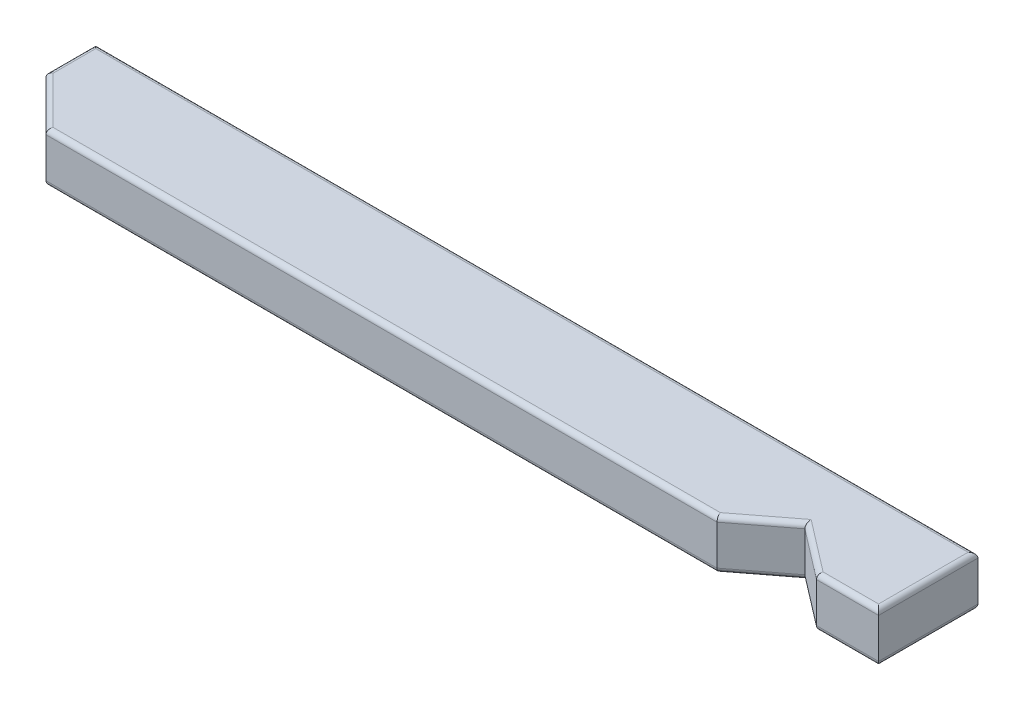
ISO-10303-21;
HEADER;
FILE_DESCRIPTION(('STEP AP214'),'2;1');
FILE_NAME('part.step','',(''),(''),'','','');
FILE_SCHEMA(('AUTOMOTIVE_DESIGN { 1 0 10303 214 1 1 1 1 }'));
ENDSEC;
DATA;
#1=APPLICATION_CONTEXT('core data for automotive mechanical design processes');
#2=APPLICATION_PROTOCOL_DEFINITION('international standard','automotive_design',2000,#1);
#3=PRODUCT_CONTEXT('',#1,'mechanical');
#4=PRODUCT('Part','Part','',(#3));
#5=PRODUCT_RELATED_PRODUCT_CATEGORY('part','',(#4));
#6=PRODUCT_DEFINITION_FORMATION('','',#4);
#7=PRODUCT_DEFINITION_CONTEXT('part definition',#1,'design');
#8=PRODUCT_DEFINITION('design','',#6,#7);
#9=PRODUCT_DEFINITION_SHAPE('','',#8);
#10=(LENGTH_UNIT() NAMED_UNIT(*) SI_UNIT(.MILLI.,.METRE.));
#11=(NAMED_UNIT(*) PLANE_ANGLE_UNIT() SI_UNIT($,.RADIAN.));
#12=(NAMED_UNIT(*) SI_UNIT($,.STERADIAN.) SOLID_ANGLE_UNIT());
#13=UNCERTAINTY_MEASURE_WITH_UNIT(LENGTH_MEASURE(1.E-05),#10,'distance_accuracy_value','');
#14=(GEOMETRIC_REPRESENTATION_CONTEXT(3) GLOBAL_UNCERTAINTY_ASSIGNED_CONTEXT((#13)) GLOBAL_UNIT_ASSIGNED_CONTEXT((#10,
#11,#12)) REPRESENTATION_CONTEXT('',''));
#15=CARTESIAN_POINT('',(0.,0.,0.));
#16=DIRECTION('',(0.,0.,1.));
#17=DIRECTION('',(1.,0.,0.));
#18=AXIS2_PLACEMENT_3D('',#15,#16,#17);
#19=CARTESIAN_POINT('',(2714.29999999996,38.1000000000004,-287.700000000002));
#20=DIRECTION('',(0.,0.,1.));
#21=DIRECTION('',(0.,-1.,0.));
#22=AXIS2_PLACEMENT_3D('',#19,#20,#21);
#23=PLANE('',#22);
#24=DIRECTION('',(0.,1.,0.));
#25=VECTOR('',#24,1.);
#26=CARTESIAN_POINT('',(1863.49999999996,-12.7000000000106,-287.700000000001));
#27=LINE('',#26,#25);
#28=CARTESIAN_POINT('',(1863.49999999996,-7.62000000000406,-287.700000000001));
#29=VERTEX_POINT('',#28);
#30=CARTESIAN_POINT('',(1863.49999999996,33.0199999999959,-287.700000000002));
#31=VERTEX_POINT('',#30);
#32=EDGE_CURVE('E211',#29,#31,#27,.T.);
#33=ORIENTED_EDGE('',*,*,#32,.F.);
#34=DIRECTION('',(-1.,0.,0.));
#35=VECTOR('',#34,1.);
#36=CARTESIAN_POINT('',(2714.29999999996,-7.61999999999961,-287.700000000001));
#37=LINE('',#36,#35);
#38=CARTESIAN_POINT('',(2549.19999999996,-7.62000000000047,-287.700000000001));
#39=VERTEX_POINT('',#38);
#40=EDGE_CURVE('E262',#29,#39,#37,.F.);
#41=ORIENTED_EDGE('',*,*,#40,.T.);
#42=DIRECTION('',(0.,1.,0.));
#43=VECTOR('',#42,1.);
#44=CARTESIAN_POINT('',(2549.19999999996,-12.700000000007,-287.700000000001));
#45=LINE('',#44,#43);
#46=CARTESIAN_POINT('',(2549.19999999996,33.0199999999995,-287.700000000002));
#47=VERTEX_POINT('',#46);
#48=EDGE_CURVE('E340',#39,#47,#45,.T.);
#49=ORIENTED_EDGE('',*,*,#48,.T.);
#50=DIRECTION('',(-1.,0.,0.));
#51=VECTOR('',#50,1.);
#52=CARTESIAN_POINT('',(1863.49999999996,33.0199999999959,-287.700000000002));
#53=LINE('',#52,#51);
#54=EDGE_CURVE('E265',#47,#31,#53,.T.);
#55=ORIENTED_EDGE('',*,*,#54,.T.);
#56=EDGE_LOOP('',(#33,#41,#49,#55));
#57=FACE_BOUND('',#56,.T.);
#58=ADVANCED_FACE('F43',(#57),#23,.T.);
#59=CARTESIAN_POINT('',(2714.29999999996,38.0999999999986,-389.300000000002));
#60=DIRECTION('',(1.,0.,0.));
#61=DIRECTION('',(0.,1.,0.));
#62=AXIS2_PLACEMENT_3D('',#59,#60,#61);
#63=PLANE('',#62);
#64=DIRECTION('',(0.,-1.,0.));
#65=VECTOR('',#64,1.);
#66=CARTESIAN_POINT('',(2714.29999999996,38.1000000000004,-287.700000000002));
#67=LINE('',#66,#65);
#68=CARTESIAN_POINT('',(2714.29999999996,33.0200000000004,-287.700000000002));
#69=VERTEX_POINT('',#68);
#70=CARTESIAN_POINT('',(2714.29999999996,-7.61999999999961,-287.700000000001));
#71=VERTEX_POINT('',#70);
#72=EDGE_CURVE('E335',#69,#71,#67,.T.);
#73=ORIENTED_EDGE('',*,*,#72,.T.);
#74=DIRECTION('',(0.,0.,1.));
#75=VECTOR('',#74,1.);
#76=CARTESIAN_POINT('',(2714.29999999996,-7.62000000000144,-389.300000000001));
#77=LINE('',#76,#75);
#78=CARTESIAN_POINT('',(2714.29999999996,-7.62000000000144,-389.300000000001));
#79=VERTEX_POINT('',#78);
#80=EDGE_CURVE('E280',#71,#79,#77,.F.);
#81=ORIENTED_EDGE('',*,*,#80,.T.);
#82=DIRECTION('',(0.,-1.,0.));
#83=VECTOR('',#82,1.);
#84=CARTESIAN_POINT('',(2714.29999999996,38.0999999999986,-389.300000000002));
#85=LINE('',#84,#83);
#86=CARTESIAN_POINT('',(2714.29999999996,33.0199999999986,-389.300000000002));
#87=VERTEX_POINT('',#86);
#88=EDGE_CURVE('E181',#87,#79,#85,.T.);
#89=ORIENTED_EDGE('',*,*,#88,.F.);
#90=DIRECTION('',(0.,0.,1.));
#91=VECTOR('',#90,1.);
#92=CARTESIAN_POINT('',(2714.29999999996,33.0200000000004,-287.700000000002));
#93=LINE('',#92,#91);
#94=EDGE_CURVE('E283',#87,#69,#93,.T.);
#95=ORIENTED_EDGE('',*,*,#94,.T.);
#96=EDGE_LOOP('',(#73,#81,#89,#95));
#97=FACE_BOUND('',#96,.T.);
#98=ADVANCED_FACE('F403',(#97),#63,.T.);
#99=CARTESIAN_POINT('',(2714.29999999996,38.0999999999986,-389.300000000002));
#100=DIRECTION('',(0.,0.,-1.));
#101=DIRECTION('',(0.,1.,0.));
#102=AXIS2_PLACEMENT_3D('',#99,#100,#101);
#103=PLANE('',#102);
#104=ORIENTED_EDGE('',*,*,#88,.T.);
#105=DIRECTION('',(1.,0.,0.));
#106=VECTOR('',#105,1.);
#107=CARTESIAN_POINT('',(2714.29999999996,-7.62000000000145,-389.300000000001));
#108=LINE('',#107,#106);
#109=CARTESIAN_POINT('',(1812.69999999996,-7.62000000000616,-389.300000000001));
#110=VERTEX_POINT('',#109);
#111=EDGE_CURVE('E11',#79,#110,#108,.F.);
#112=ORIENTED_EDGE('',*,*,#111,.T.);
#113=DIRECTION('',(0.,-1.,0.));
#114=VECTOR('',#113,1.);
#115=CARTESIAN_POINT('',(1812.69999999996,38.0999999999938,-389.300000000002));
#116=LINE('',#115,#114);
#117=CARTESIAN_POINT('',(1812.69999999996,33.0199999999938,-389.300000000002));
#118=VERTEX_POINT('',#117);
#119=EDGE_CURVE('E339',#118,#110,#116,.T.);
#120=ORIENTED_EDGE('',*,*,#119,.F.);
#121=DIRECTION('',(1.,0.,0.));
#122=VECTOR('',#121,1.);
#123=CARTESIAN_POINT('',(2714.29999999996,33.0199999999986,-389.300000000002));
#124=LINE('',#123,#122);
#125=EDGE_CURVE('E53',#118,#87,#124,.T.);
#126=ORIENTED_EDGE('',*,*,#125,.T.);
#127=EDGE_LOOP('',(#104,#112,#120,#126));
#128=FACE_BOUND('',#127,.T.);
#129=ADVANCED_FACE('F387',(#128),#103,.T.);
#130=CARTESIAN_POINT('',(1812.69999999996,38.0999999999938,-389.300000000002));
#131=DIRECTION('',(-1.,0.,0.));
#132=DIRECTION('',(0.,-1.,0.));
#133=AXIS2_PLACEMENT_3D('',#130,#131,#132);
#134=PLANE('',#133);
#135=ORIENTED_EDGE('',*,*,#119,.T.);
#136=DIRECTION('',(0.,0.,-1.));
#137=VECTOR('',#136,1.);
#138=CARTESIAN_POINT('',(1812.69999999996,-7.62000000000616,-389.300000000001));
#139=LINE('',#138,#137);
#140=CARTESIAN_POINT('',(1812.69999999996,-7.62000000000524,-338.5));
#141=VERTEX_POINT('',#140);
#142=EDGE_CURVE('E184',#110,#141,#139,.F.);
#143=ORIENTED_EDGE('',*,*,#142,.T.);
#144=DIRECTION('',(0.,1.,0.));
#145=VECTOR('',#144,1.);
#146=CARTESIAN_POINT('',(1812.69999999996,-12.7000000000118,-338.5));
#147=LINE('',#146,#145);
#148=CARTESIAN_POINT('',(1812.69999999996,33.0199999999947,-338.500000000001));
#149=VERTEX_POINT('',#148);
#150=EDGE_CURVE('E348',#141,#149,#147,.T.);
#151=ORIENTED_EDGE('',*,*,#150,.T.);
#152=DIRECTION('',(0.,0.,-1.));
#153=VECTOR('',#152,1.);
#154=CARTESIAN_POINT('',(1812.69999999996,33.0199999999938,-389.300000000002));
#155=LINE('',#154,#153);
#156=EDGE_CURVE('E66',#149,#118,#155,.T.);
#157=ORIENTED_EDGE('',*,*,#156,.T.);
#158=EDGE_LOOP('',(#135,#143,#151,#157));
#159=FACE_BOUND('',#158,.T.);
#160=ADVANCED_FACE('F385',(#159),#134,.T.);
#161=DIRECTION('',(0.,1.,0.));
#162=VECTOR('',#161,1.);
#163=CARTESIAN_POINT('',(2650.79999999996,-12.7000000000065,-287.700000000001));
#164=LINE('',#163,#162);
#165=CARTESIAN_POINT('',(2650.79999999996,-7.61999999999994,-287.700000000001));
#166=VERTEX_POINT('',#165);
#167=CARTESIAN_POINT('',(2650.79999999996,33.02,-287.700000000002));
#168=VERTEX_POINT('',#167);
#169=EDGE_CURVE('E351',#166,#168,#164,.T.);
#170=ORIENTED_EDGE('',*,*,#169,.F.);
#171=DIRECTION('',(-1.,0.,0.));
#172=VECTOR('',#171,1.);
#173=CARTESIAN_POINT('',(2714.29999999996,-7.61999999999961,-287.700000000001));
#174=LINE('',#173,#172);
#175=EDGE_CURVE('E252',#166,#71,#174,.F.);
#176=ORIENTED_EDGE('',*,*,#175,.T.);
#177=ORIENTED_EDGE('',*,*,#72,.F.);
#178=DIRECTION('',(-1.,0.,0.));
#179=VECTOR('',#178,1.);
#180=CARTESIAN_POINT('',(2650.79999999996,33.0200000000001,-287.700000000002));
#181=LINE('',#180,#179);
#182=EDGE_CURVE('E255',#69,#168,#181,.T.);
#183=ORIENTED_EDGE('',*,*,#182,.T.);
#184=EDGE_LOOP('',(#170,#176,#177,#183));
#185=FACE_BOUND('',#184,.T.);
#186=ADVANCED_FACE('F408',(#185),#23,.T.);
#187=CARTESIAN_POINT('',(-1.99220196198041E-13,38.0999999999914,-6.8906450224136E-13));
#188=DIRECTION('',(0.,-1.,0.));
#189=DIRECTION('',(0.,0.,-1.));
#190=AXIS2_PLACEMENT_3D('',#187,#188,#189);
#191=PLANE('',#190);
#192=DIRECTION('',(-0.793353340291236,0.,0.60876142900872));
#193=VECTOR('',#192,1.);
#194=CARTESIAN_POINT('',(802.668306941263,38.1000000000145,1046.05770358135));
#195=LINE('',#194,#193);
#196=CARTESIAN_POINT('',(2547.47557236494,38.0999999999994,-292.780000000002));
#197=VERTEX_POINT('',#196);
#198=CARTESIAN_POINT('',(2599.99999999996,38.099999999999,-333.083410852505));
#199=VERTEX_POINT('',#198);
#200=EDGE_CURVE('E289',#197,#199,#195,.F.);
#201=ORIENTED_EDGE('',*,*,#200,.T.);
#202=DIRECTION('',(-0.793353340291237,0.,-0.608761429008719));
#203=VECTOR('',#202,1.);
#204=CARTESIAN_POINT('',(1124.40217579215,38.0999999999708,-1465.34944477019));
#205=LINE('',#204,#203);
#206=CARTESIAN_POINT('',(2652.52442763499,38.1,-292.780000000002));
#207=VERTEX_POINT('',#206);
#208=EDGE_CURVE('E286',#199,#207,#205,.F.);
#209=ORIENTED_EDGE('',*,*,#208,.T.);
#210=DIRECTION('',(-1.,0.,0.));
#211=VECTOR('',#210,1.);
#212=CARTESIAN_POINT('',(2714.29999999996,38.1000000000003,-292.780000000002));
#213=LINE('',#212,#211);
#214=CARTESIAN_POINT('',(2709.21999999996,38.1000000000003,-292.780000000002));
#215=VERTEX_POINT('',#214);
#216=EDGE_CURVE('E295',#207,#215,#213,.F.);
#217=ORIENTED_EDGE('',*,*,#216,.T.);
#218=DIRECTION('',(0.,0.,1.));
#219=VECTOR('',#218,1.);
#220=CARTESIAN_POINT('',(2709.21999999996,38.0999999999985,-389.300000000002));
#221=LINE('',#220,#219);
#222=CARTESIAN_POINT('',(2709.21999999996,38.0999999999986,-384.220000000002));
#223=VERTEX_POINT('',#222);
#224=EDGE_CURVE('E302',#215,#223,#221,.F.);
#225=ORIENTED_EDGE('',*,*,#224,.T.);
#226=DIRECTION('',(1.,0.,0.));
#227=VECTOR('',#226,1.);
#228=CARTESIAN_POINT('',(1812.69999999996,38.0999999999939,-384.220000000002));
#229=LINE('',#228,#227);
#230=CARTESIAN_POINT('',(1817.77999999996,38.099999999994,-384.220000000002));
#231=VERTEX_POINT('',#230);
#232=EDGE_CURVE('E308',#223,#231,#229,.F.);
#233=ORIENTED_EDGE('',*,*,#232,.T.);
#234=DIRECTION('',(0.,0.,-1.));
#235=VECTOR('',#234,1.);
#236=CARTESIAN_POINT('',(1817.77999999996,38.0999999999948,-338.500000000001));
#237=LINE('',#236,#235);
#238=CARTESIAN_POINT('',(1817.77999999996,38.0999999999948,-340.604204896856));
#239=VERTEX_POINT('',#238);
#240=EDGE_CURVE('E305',#231,#239,#237,.F.);
#241=ORIENTED_EDGE('',*,*,#240,.T.);
#242=DIRECTION('',(-0.707106781186551,0.,-0.707106781186544));
#243=VECTOR('',#242,1.);
#244=CARTESIAN_POINT('',(1079.1921024484,38.0999999999775,-1079.19210244841));
#245=LINE('',#244,#243);
#246=CARTESIAN_POINT('',(1865.60420489682,38.0999999999959,-292.780000000002));
#247=VERTEX_POINT('',#246);
#248=EDGE_CURVE('E298',#239,#247,#245,.F.);
#249=ORIENTED_EDGE('',*,*,#248,.T.);
#250=DIRECTION('',(-1.,0.,0.));
#251=VECTOR('',#250,1.);
#252=CARTESIAN_POINT('',(2549.19999999996,38.0999999999994,-292.780000000002));
#253=LINE('',#252,#251);
#254=EDGE_CURVE('E292',#247,#197,#253,.F.);
#255=ORIENTED_EDGE('',*,*,#254,.T.);
#256=EDGE_LOOP('',(#201,#209,#217,#225,#233,#241,#249,#255));
#257=FACE_BOUND('',#256,.T.);
#258=ADVANCED_FACE('F398',(#257),#191,.F.);
#259=CARTESIAN_POINT('',(0.,-12.7000000000086,2.29417179698088E-13));
#260=DIRECTION('',(0.,-1.,0.));
#261=DIRECTION('',(0.,0.,-1.));
#262=AXIS2_PLACEMENT_3D('',#259,#260,#261);
#263=PLANE('',#262);
#264=DIRECTION('',(-1.,0.,0.));
#265=VECTOR('',#264,1.);
#266=CARTESIAN_POINT('',(0.,-12.7000000000139,-292.780000000001));
#267=LINE('',#266,#265);
#268=CARTESIAN_POINT('',(2709.21999999996,-12.6999999999997,-292.780000000001));
#269=VERTEX_POINT('',#268);
#270=CARTESIAN_POINT('',(2652.52442763499,-12.7,-292.780000000001));
#271=VERTEX_POINT('',#270);
#272=EDGE_CURVE('E328',#269,#271,#267,.T.);
#273=ORIENTED_EDGE('',*,*,#272,.T.);
#274=DIRECTION('',(-0.793353340291237,0.,-0.608761429008719));
#275=VECTOR('',#274,1.);
#276=CARTESIAN_POINT('',(2603.09250805933,-12.700000000001,-330.710445958012));
#277=LINE('',#276,#275);
#278=CARTESIAN_POINT('',(2599.99999999996,-12.700000000001,-333.083410852505));
#279=VERTEX_POINT('',#278);
#280=EDGE_CURVE('E319',#271,#279,#277,.T.);
#281=ORIENTED_EDGE('',*,*,#280,.T.);
#282=DIRECTION('',(-0.793353340291236,0.,0.60876142900872));
#283=VECTOR('',#282,1.);
#284=CARTESIAN_POINT('',(2546.1074919406,-12.7000000000006,-291.73023496868));
#285=LINE('',#284,#283);
#286=CARTESIAN_POINT('',(2547.47557236494,-12.7000000000006,-292.780000000001));
#287=VERTEX_POINT('',#286);
#288=EDGE_CURVE('E322',#279,#287,#285,.T.);
#289=ORIENTED_EDGE('',*,*,#288,.T.);
#290=DIRECTION('',(-1.,0.,0.));
#291=VECTOR('',#290,1.);
#292=CARTESIAN_POINT('',(0.,-12.7000000000139,-292.780000000001));
#293=LINE('',#292,#291);
#294=CARTESIAN_POINT('',(1865.60420489682,-12.7000000000041,-292.780000000001));
#295=VERTEX_POINT('',#294);
#296=EDGE_CURVE('E325',#287,#295,#293,.T.);
#297=ORIENTED_EDGE('',*,*,#296,.T.);
#298=DIRECTION('',(-0.707106781186551,0.,-0.707106781186544));
#299=VECTOR('',#298,1.);
#300=CARTESIAN_POINT('',(1816.29210244839,-12.7000000000053,-342.092102448428));
#301=LINE('',#300,#299);
#302=CARTESIAN_POINT('',(1817.77999999996,-12.7000000000052,-340.604204896855));
#303=VERTEX_POINT('',#302);
#304=EDGE_CURVE('E165',#295,#303,#301,.T.);
#305=ORIENTED_EDGE('',*,*,#304,.T.);
#306=DIRECTION('',(0.,0.,-1.));
#307=VECTOR('',#306,1.);
#308=CARTESIAN_POINT('',(1817.77999999996,-12.6999999999991,2.29417179697916E-13));
#309=LINE('',#308,#307);
#310=CARTESIAN_POINT('',(1817.77999999996,-12.700000000006,-384.220000000001));
#311=VERTEX_POINT('',#310);
#312=EDGE_CURVE('E159',#303,#311,#309,.T.);
#313=ORIENTED_EDGE('',*,*,#312,.T.);
#314=DIRECTION('',(1.,0.,0.));
#315=VECTOR('',#314,1.);
#316=CARTESIAN_POINT('',(0.,-12.7000000000155,-384.220000000001));
#317=LINE('',#316,#315);
#318=CARTESIAN_POINT('',(2709.21999999996,-12.7000000000014,-384.220000000001));
#319=VERTEX_POINT('',#318);
#320=EDGE_CURVE('E162',#311,#319,#317,.T.);
#321=ORIENTED_EDGE('',*,*,#320,.T.);
#322=DIRECTION('',(0.,0.,1.));
#323=VECTOR('',#322,1.);
#324=CARTESIAN_POINT('',(2709.21999999996,-12.6999999999944,2.29417179697832E-13));
#325=LINE('',#324,#323);
#326=EDGE_CURVE('E170',#319,#269,#325,.T.);
#327=ORIENTED_EDGE('',*,*,#326,.T.);
#328=EDGE_LOOP('',(#273,#281,#289,#297,#305,#313,#321,#327));
#329=FACE_BOUND('',#328,.T.);
#330=ADVANCED_FACE('F161',(#329),#263,.T.);
#331=CARTESIAN_POINT('',(1863.49999999996,-12.7000000000106,-287.700000000001));
#332=DIRECTION('',(0.707106781186544,0.,-0.707106781186551));
#333=DIRECTION('',(-0.707106781186551,0.,-0.707106781186544));
#334=AXIS2_PLACEMENT_3D('',#331,#332,#333);
#335=PLANE('',#334);
#336=ORIENTED_EDGE('',*,*,#150,.F.);
#337=DIRECTION('',(-0.707106781186551,0.,-0.707106781186544));
#338=VECTOR('',#337,1.);
#339=CARTESIAN_POINT('',(1863.49999999996,-7.62000000000405,-287.700000000001));
#340=LINE('',#339,#338);
#341=EDGE_CURVE('E311',#141,#29,#340,.F.);
#342=ORIENTED_EDGE('',*,*,#341,.T.);
#343=ORIENTED_EDGE('',*,*,#32,.T.);
#344=DIRECTION('',(-0.707106781186551,0.,-0.707106781186544));
#345=VECTOR('',#344,1.);
#346=CARTESIAN_POINT('',(1863.49999999996,33.0199999999959,-287.700000000002));
#347=LINE('',#346,#345);
#348=EDGE_CURVE('E315',#31,#149,#347,.T.);
#349=ORIENTED_EDGE('',*,*,#348,.T.);
#350=EDGE_LOOP('',(#336,#342,#343,#349));
#351=FACE_BOUND('',#350,.T.);
#352=ADVANCED_FACE('F384',(#351),#335,.F.);
#353=CARTESIAN_POINT('',(2549.19999999996,-12.700000000007,-287.700000000001));
#354=DIRECTION('',(-0.60876142900872,0.,-0.793353340291236));
#355=DIRECTION('',(-0.793353340291236,0.,0.60876142900872));
#356=AXIS2_PLACEMENT_3D('',#353,#354,#355);
#357=PLANE('',#356);
#358=ORIENTED_EDGE('',*,*,#48,.F.);
#359=DIRECTION('',(-0.793353340291236,0.,0.60876142900872));
#360=VECTOR('',#359,1.);
#361=CARTESIAN_POINT('',(2599.99999999996,-7.62000000000091,-326.680210989332));
#362=LINE('',#361,#360);
#363=CARTESIAN_POINT('',(2599.99999999996,-7.62000000000091,-326.680210989332));
#364=VERTEX_POINT('',#363);
#365=EDGE_CURVE('E268',#39,#364,#362,.F.);
#366=ORIENTED_EDGE('',*,*,#365,.T.);
#367=DIRECTION('',(0.,1.,0.));
#368=VECTOR('',#367,1.);
#369=CARTESIAN_POINT('',(2599.99999999996,-12.7000000000075,-326.680210989332));
#370=LINE('',#369,#368);
#371=CARTESIAN_POINT('',(2599.99999999996,33.0199999999991,-326.680210989333));
#372=VERTEX_POINT('',#371);
#373=EDGE_CURVE('E355',#364,#372,#370,.T.);
#374=ORIENTED_EDGE('',*,*,#373,.T.);
#375=DIRECTION('',(-0.793353340291236,0.,0.60876142900872));
#376=VECTOR('',#375,1.);
#377=CARTESIAN_POINT('',(2549.19999999996,33.0199999999995,-287.700000000002));
#378=LINE('',#377,#376);
#379=EDGE_CURVE('E271',#372,#47,#378,.T.);
#380=ORIENTED_EDGE('',*,*,#379,.T.);
#381=EDGE_LOOP('',(#358,#366,#374,#380));
#382=FACE_BOUND('',#381,.T.);
#383=ADVANCED_FACE('F417',(#382),#357,.F.);
#384=CARTESIAN_POINT('',(2599.99999999996,-12.7000000000075,-326.680210989332));
#385=DIRECTION('',(0.608761429008719,0.,-0.793353340291236));
#386=DIRECTION('',(-0.793353340291237,0.,-0.608761429008719));
#387=AXIS2_PLACEMENT_3D('',#384,#385,#386);
#388=PLANE('',#387);
#389=ORIENTED_EDGE('',*,*,#373,.F.);
#390=DIRECTION('',(-0.793353340291237,0.,-0.608761429008719));
#391=VECTOR('',#390,1.);
#392=CARTESIAN_POINT('',(2650.79999999996,-7.61999999999994,-287.700000000001));
#393=LINE('',#392,#391);
#394=EDGE_CURVE('E274',#364,#166,#393,.F.);
#395=ORIENTED_EDGE('',*,*,#394,.T.);
#396=ORIENTED_EDGE('',*,*,#169,.T.);
#397=DIRECTION('',(-0.793353340291237,0.,-0.608761429008719));
#398=VECTOR('',#397,1.);
#399=CARTESIAN_POINT('',(2599.99999999996,33.0199999999991,-326.680210989333));
#400=LINE('',#399,#398);
#401=EDGE_CURVE('E277',#168,#372,#400,.T.);
#402=ORIENTED_EDGE('',*,*,#401,.T.);
#403=EDGE_LOOP('',(#389,#395,#396,#402));
#404=FACE_BOUND('',#403,.T.);
#405=ADVANCED_FACE('F415',(#404),#388,.F.);
#406=CARTESIAN_POINT('',(0.,-7.62000000001389,-292.780000000001));
#407=DIRECTION('',(-1.,0.,0.));
#408=DIRECTION('',(0.,-1.,0.));
#409=AXIS2_PLACEMENT_3D('',#406,#407,#408);
#410=CYLINDRICAL_SURFACE('',#409,5.08);
#411=CARTESIAN_POINT('',(2709.21999999996,-7.61999999999972,-292.780000000001));
#412=DIRECTION('',(-0.707106781186547,0.,0.707106781186547));
#413=DIRECTION('',(-0.707106781186547,0.,-0.707106781186547));
#414=AXIS2_PLACEMENT_3D('',#411,#412,#413);
#415=ELLIPSE('',#414,7.18420489685532,5.08);
#416=EDGE_CURVE('E203',#71,#269,#415,.F.);
#417=ORIENTED_EDGE('',*,*,#416,.F.);
#418=ORIENTED_EDGE('',*,*,#175,.F.);
#419=CARTESIAN_POINT('',(2652.52442763499,-7.62000000000002,-292.780000000001));
#420=DIRECTION('',(-0.946930129495106,0.,-0.321439465303161));
#421=DIRECTION('',(-0.32143946530316,0.,0.946930129495106));
#422=AXIS2_PLACEMENT_3D('',#419,#420,#421);
#423=ELLIPSE('',#422,5.36470415479187,5.08);
#424=EDGE_CURVE('E207',#271,#166,#423,.T.);
#425=ORIENTED_EDGE('',*,*,#424,.F.);
#426=ORIENTED_EDGE('',*,*,#272,.F.);
#427=EDGE_LOOP('',(#417,#418,#425,#426));
#428=FACE_BOUND('',#427,.T.);
#429=ADVANCED_FACE('F433',(#428),#410,.T.);
#430=CARTESIAN_POINT('',(1124.40217579215,-7.62000000002919,-1465.34944477019));
#431=DIRECTION('',(0.793353340291237,0.,0.608761429008719));
#432=DIRECTION('',(0.608761429008719,0.,-0.793353340291237));
#433=AXIS2_PLACEMENT_3D('',#430,#431,#432);
#434=CYLINDRICAL_SURFACE('',#433,5.08);
#435=ORIENTED_EDGE('',*,*,#424,.T.);
#436=ORIENTED_EDGE('',*,*,#394,.F.);
#437=CARTESIAN_POINT('',(2599.99999999996,-7.62000000000102,-333.083410852504));
#438=DIRECTION('',(1.,0.,0.));
#439=DIRECTION('',(0.,0.,1.));
#440=AXIS2_PLACEMENT_3D('',#437,#438,#439);
#441=ELLIPSE('',#440,6.40319986317214,5.08);
#442=EDGE_CURVE('E199',#279,#364,#441,.F.);
#443=ORIENTED_EDGE('',*,*,#442,.F.);
#444=ORIENTED_EDGE('',*,*,#280,.F.);
#445=EDGE_LOOP('',(#435,#436,#443,#444));
#446=FACE_BOUND('',#445,.T.);
#447=ADVANCED_FACE('F431',(#446),#434,.T.);
#448=CARTESIAN_POINT('',(2709.21999999996,-7.61999999999443,1.37650307818659E-13));
#449=DIRECTION('',(0.,0.,1.));
#450=DIRECTION('',(0.,-1.,0.));
#451=AXIS2_PLACEMENT_3D('',#448,#449,#450);
#452=CYLINDRICAL_SURFACE('',#451,5.08);
#453=ORIENTED_EDGE('',*,*,#416,.T.);
#454=ORIENTED_EDGE('',*,*,#326,.F.);
#455=CARTESIAN_POINT('',(2709.21999999996,-7.62000000000138,-384.220000000001));
#456=DIRECTION('',(0.707106781186547,0.,0.707106781186547));
#457=DIRECTION('',(0.707106781186547,0.,-0.707106781186547));
#458=AXIS2_PLACEMENT_3D('',#455,#456,#457);
#459=ELLIPSE('',#458,7.18420489685532,5.08);
#460=EDGE_CURVE('E179',#79,#319,#459,.F.);
#461=ORIENTED_EDGE('',*,*,#460,.F.);
#462=ORIENTED_EDGE('',*,*,#80,.F.);
#463=EDGE_LOOP('',(#453,#454,#461,#462));
#464=FACE_BOUND('',#463,.T.);
#465=ADVANCED_FACE('F436',(#464),#452,.T.);
#466=CARTESIAN_POINT('',(802.668306941263,-7.61999999998551,1046.05770358135));
#467=DIRECTION('',(0.793353340291236,0.,-0.60876142900872));
#468=DIRECTION('',(-0.60876142900872,0.,-0.793353340291236));
#469=AXIS2_PLACEMENT_3D('',#466,#467,#468);
#470=CYLINDRICAL_SURFACE('',#469,5.08);
#471=ORIENTED_EDGE('',*,*,#442,.T.);
#472=ORIENTED_EDGE('',*,*,#365,.F.);
#473=CARTESIAN_POINT('',(2547.47557236494,-7.62000000000057,-292.780000000001));
#474=DIRECTION('',(-0.946930129495106,0.,0.321439465303161));
#475=DIRECTION('',(-0.321439465303161,0.,-0.946930129495106));
#476=AXIS2_PLACEMENT_3D('',#473,#474,#475);
#477=ELLIPSE('',#476,5.36470415479187,5.08);
#478=EDGE_CURVE('E186',#287,#39,#477,.T.);
#479=ORIENTED_EDGE('',*,*,#478,.F.);
#480=ORIENTED_EDGE('',*,*,#288,.F.);
#481=EDGE_LOOP('',(#471,#472,#479,#480));
#482=FACE_BOUND('',#481,.T.);
#483=ADVANCED_FACE('F420',(#482),#470,.T.);
#484=CARTESIAN_POINT('',(0.,-7.62000000001554,-384.220000000001));
#485=DIRECTION('',(1.,0.,0.));
#486=DIRECTION('',(0.,1.,0.));
#487=AXIS2_PLACEMENT_3D('',#484,#485,#486);
#488=CYLINDRICAL_SURFACE('',#487,5.08);
#489=ORIENTED_EDGE('',*,*,#460,.T.);
#490=ORIENTED_EDGE('',*,*,#320,.F.);
#491=CARTESIAN_POINT('',(1817.77999999996,-7.62000000000604,-384.220000000001));
#492=DIRECTION('',(0.707106781186547,0.,-0.707106781186547));
#493=DIRECTION('',(0.707106781186547,0.,0.707106781186547));
#494=AXIS2_PLACEMENT_3D('',#491,#492,#493);
#495=ELLIPSE('',#494,7.18420489685532,5.08);
#496=EDGE_CURVE('E176',#110,#311,#495,.F.);
#497=ORIENTED_EDGE('',*,*,#496,.F.);
#498=ORIENTED_EDGE('',*,*,#111,.F.);
#499=EDGE_LOOP('',(#489,#490,#497,#498));
#500=FACE_BOUND('',#499,.T.);
#501=ADVANCED_FACE('F175',(#500),#488,.T.);
#502=CARTESIAN_POINT('',(0.,-7.62000000001389,-292.780000000001));
#503=DIRECTION('',(-1.,0.,0.));
#504=DIRECTION('',(0.,-1.,0.));
#505=AXIS2_PLACEMENT_3D('',#502,#503,#504);
#506=CYLINDRICAL_SURFACE('',#505,5.08);
#507=ORIENTED_EDGE('',*,*,#478,.T.);
#508=ORIENTED_EDGE('',*,*,#40,.F.);
#509=CARTESIAN_POINT('',(1865.60420489682,-7.62000000000413,-292.780000000001));
#510=DIRECTION('',(-0.923879532511288,0.,-0.382683432365087));
#511=DIRECTION('',(-0.382683432365087,0.,0.923879532511288));
#512=AXIS2_PLACEMENT_3D('',#509,#510,#511);
#513=ELLIPSE('',#512,5.49855237748536,5.08);
#514=EDGE_CURVE('E187',#295,#29,#513,.T.);
#515=ORIENTED_EDGE('',*,*,#514,.F.);
#516=ORIENTED_EDGE('',*,*,#296,.F.);
#517=EDGE_LOOP('',(#507,#508,#515,#516));
#518=FACE_BOUND('',#517,.T.);
#519=ADVANCED_FACE('F425',(#518),#506,.T.);
#520=CARTESIAN_POINT('',(1817.77999999996,-7.6199999999991,1.37650307818743E-13));
#521=DIRECTION('',(0.,0.,-1.));
#522=DIRECTION('',(0.,1.,0.));
#523=AXIS2_PLACEMENT_3D('',#520,#521,#522);
#524=CYLINDRICAL_SURFACE('',#523,5.08);
#525=ORIENTED_EDGE('',*,*,#496,.T.);
#526=ORIENTED_EDGE('',*,*,#312,.F.);
#527=CARTESIAN_POINT('',(1817.77999999996,-7.62000000000525,-340.604204896855));
#528=DIRECTION('',(-0.382683432365092,0.,-0.923879532511286));
#529=DIRECTION('',(0.923879532511286,0.,-0.382683432365092));
#530=AXIS2_PLACEMENT_3D('',#527,#528,#529);
#531=ELLIPSE('',#530,5.49855237748537,5.08);
#532=EDGE_CURVE('E193',#141,#303,#531,.F.);
#533=ORIENTED_EDGE('',*,*,#532,.F.);
#534=ORIENTED_EDGE('',*,*,#142,.F.);
#535=EDGE_LOOP('',(#525,#526,#533,#534));
#536=FACE_BOUND('',#535,.T.);
#537=ADVANCED_FACE('F183',(#536),#524,.T.);
#538=CARTESIAN_POINT('',(1079.1921024484,-7.62000000002245,-1079.19210244841));
#539=DIRECTION('',(0.707106781186551,0.,0.707106781186544));
#540=DIRECTION('',(0.707106781186544,0.,-0.707106781186551));
#541=AXIS2_PLACEMENT_3D('',#538,#539,#540);
#542=CYLINDRICAL_SURFACE('',#541,5.08);
#543=ORIENTED_EDGE('',*,*,#514,.T.);
#544=ORIENTED_EDGE('',*,*,#341,.F.);
#545=ORIENTED_EDGE('',*,*,#532,.T.);
#546=ORIENTED_EDGE('',*,*,#304,.F.);
#547=EDGE_LOOP('',(#543,#544,#545,#546));
#548=FACE_BOUND('',#547,.T.);
#549=ADVANCED_FACE('F528',(#548),#542,.T.);
#550=CARTESIAN_POINT('',(2714.29999999996,33.0200000000003,-292.780000000002));
#551=DIRECTION('',(1.,0.,0.));
#552=DIRECTION('',(0.,1.,0.));
#553=AXIS2_PLACEMENT_3D('',#550,#551,#552);
#554=CYLINDRICAL_SURFACE('',#553,5.08);
#555=CARTESIAN_POINT('',(2709.21999999996,33.0200000000003,-292.780000000002));
#556=DIRECTION('',(0.707106781186547,0.,-0.707106781186547));
#557=DIRECTION('',(0.707106781186547,0.,0.707106781186547));
#558=AXIS2_PLACEMENT_3D('',#555,#556,#557);
#559=ELLIPSE('',#558,7.18420489685532,5.08);
#560=EDGE_CURVE('E233',#215,#69,#559,.T.);
#561=ORIENTED_EDGE('',*,*,#560,.F.);
#562=ORIENTED_EDGE('',*,*,#216,.F.);
#563=CARTESIAN_POINT('',(2652.52442763499,33.02,-292.780000000002));
#564=DIRECTION('',(0.946930129495106,0.,0.321439465303161));
#565=DIRECTION('',(0.32143946530316,0.,-0.946930129495106));
#566=AXIS2_PLACEMENT_3D('',#563,#564,#565);
#567=ELLIPSE('',#566,5.36470415479187,5.08);
#568=EDGE_CURVE('E47',#168,#207,#567,.F.);
#569=ORIENTED_EDGE('',*,*,#568,.F.);
#570=ORIENTED_EDGE('',*,*,#182,.F.);
#571=EDGE_LOOP('',(#561,#562,#569,#570));
#572=FACE_BOUND('',#571,.T.);
#573=ADVANCED_FACE('F45',(#572),#554,.T.);
#574=CARTESIAN_POINT('',(2603.09250805933,33.019999999999,-330.710445958012));
#575=DIRECTION('',(-0.793353340291237,0.,-0.608761429008719));
#576=DIRECTION('',(-0.608761429008719,0.,0.793353340291237));
#577=AXIS2_PLACEMENT_3D('',#574,#575,#576);
#578=CYLINDRICAL_SURFACE('',#577,5.08);
#579=ORIENTED_EDGE('',*,*,#568,.T.);
#580=ORIENTED_EDGE('',*,*,#208,.F.);
#581=CARTESIAN_POINT('',(2599.99999999996,33.019999999999,-333.083410852505));
#582=DIRECTION('',(-1.,0.,0.));
#583=DIRECTION('',(0.,0.,-1.));
#584=AXIS2_PLACEMENT_3D('',#581,#582,#583);
#585=ELLIPSE('',#584,6.40319986317214,5.08);
#586=EDGE_CURVE('E230',#372,#199,#585,.T.);
#587=ORIENTED_EDGE('',*,*,#586,.F.);
#588=ORIENTED_EDGE('',*,*,#401,.F.);
#589=EDGE_LOOP('',(#579,#580,#587,#588));
#590=FACE_BOUND('',#589,.T.);
#591=ADVANCED_FACE('F412',(#590),#578,.T.);
#592=CARTESIAN_POINT('',(2709.21999999996,33.0199999999985,-389.300000000002));
#593=DIRECTION('',(0.,0.,-1.));
#594=DIRECTION('',(0.,1.,0.));
#595=AXIS2_PLACEMENT_3D('',#592,#593,#594);
#596=CYLINDRICAL_SURFACE('',#595,5.08);
#597=ORIENTED_EDGE('',*,*,#560,.T.);
#598=ORIENTED_EDGE('',*,*,#94,.F.);
#599=CARTESIAN_POINT('',(2709.21999999996,33.0199999999986,-384.220000000002));
#600=DIRECTION('',(-0.707106781186547,0.,-0.707106781186547));
#601=DIRECTION('',(-0.707106781186547,0.,0.707106781186547));
#602=AXIS2_PLACEMENT_3D('',#599,#600,#601);
#603=ELLIPSE('',#602,7.18420489685532,5.08);
#604=EDGE_CURVE('E226',#223,#87,#603,.T.);
#605=ORIENTED_EDGE('',*,*,#604,.F.);
#606=ORIENTED_EDGE('',*,*,#224,.F.);
#607=EDGE_LOOP('',(#597,#598,#605,#606));
#608=FACE_BOUND('',#607,.T.);
#609=ADVANCED_FACE('F400',(#608),#596,.T.);
#610=CARTESIAN_POINT('',(2546.1074919406,33.0199999999994,-291.730234968681));
#611=DIRECTION('',(-0.793353340291236,0.,0.60876142900872));
#612=DIRECTION('',(0.60876142900872,0.,0.793353340291236));
#613=AXIS2_PLACEMENT_3D('',#610,#611,#612);
#614=CYLINDRICAL_SURFACE('',#613,5.08);
#615=ORIENTED_EDGE('',*,*,#586,.T.);
#616=ORIENTED_EDGE('',*,*,#200,.F.);
#617=CARTESIAN_POINT('',(2547.47557236494,33.0199999999994,-292.780000000002));
#618=DIRECTION('',(0.946930129495106,0.,-0.321439465303161));
#619=DIRECTION('',(0.321439465303161,0.,0.946930129495106));
#620=AXIS2_PLACEMENT_3D('',#617,#618,#619);
#621=ELLIPSE('',#620,5.36470415479187,5.08);
#622=EDGE_CURVE('E222',#47,#197,#621,.F.);
#623=ORIENTED_EDGE('',*,*,#622,.F.);
#624=ORIENTED_EDGE('',*,*,#379,.F.);
#625=EDGE_LOOP('',(#615,#616,#623,#624));
#626=FACE_BOUND('',#625,.T.);
#627=ADVANCED_FACE('F372',(#626),#614,.T.);
#628=CARTESIAN_POINT('',(2714.29999999996,33.0199999999986,-384.220000000002));
#629=DIRECTION('',(-1.,0.,0.));
#630=DIRECTION('',(0.,-1.,0.));
#631=AXIS2_PLACEMENT_3D('',#628,#629,#630);
#632=CYLINDRICAL_SURFACE('',#631,5.08);
#633=ORIENTED_EDGE('',*,*,#604,.T.);
#634=ORIENTED_EDGE('',*,*,#125,.F.);
#635=CARTESIAN_POINT('',(1817.77999999996,33.019999999994,-384.220000000002));
#636=DIRECTION('',(-0.707106781186547,0.,0.707106781186547));
#637=DIRECTION('',(-0.707106781186547,0.,-0.707106781186547));
#638=AXIS2_PLACEMENT_3D('',#635,#636,#637);
#639=ELLIPSE('',#638,7.18420489685532,5.08);
#640=EDGE_CURVE('E218',#231,#118,#639,.T.);
#641=ORIENTED_EDGE('',*,*,#640,.F.);
#642=ORIENTED_EDGE('',*,*,#232,.F.);
#643=EDGE_LOOP('',(#633,#634,#641,#642));
#644=FACE_BOUND('',#643,.T.);
#645=ADVANCED_FACE('F391',(#644),#632,.T.);
#646=CARTESIAN_POINT('',(2714.29999999996,33.0200000000003,-292.780000000002));
#647=DIRECTION('',(1.,0.,0.));
#648=DIRECTION('',(0.,1.,0.));
#649=AXIS2_PLACEMENT_3D('',#646,#647,#648);
#650=CYLINDRICAL_SURFACE('',#649,5.08);
#651=ORIENTED_EDGE('',*,*,#622,.T.);
#652=ORIENTED_EDGE('',*,*,#254,.F.);
#653=CARTESIAN_POINT('',(1865.60420489682,33.0199999999959,-292.780000000002));
#654=DIRECTION('',(0.923879532511288,0.,0.382683432365087));
#655=DIRECTION('',(0.382683432365087,0.,-0.923879532511288));
#656=AXIS2_PLACEMENT_3D('',#653,#654,#655);
#657=ELLIPSE('',#656,5.49855237748536,5.08);
#658=EDGE_CURVE('E215',#31,#247,#657,.F.);
#659=ORIENTED_EDGE('',*,*,#658,.F.);
#660=ORIENTED_EDGE('',*,*,#54,.F.);
#661=EDGE_LOOP('',(#651,#652,#659,#660));
#662=FACE_BOUND('',#661,.T.);
#663=ADVANCED_FACE('F376',(#662),#650,.T.);
#664=CARTESIAN_POINT('',(1817.77999999996,33.0199999999939,-389.300000000002));
#665=DIRECTION('',(0.,0.,1.));
#666=DIRECTION('',(0.,-1.,0.));
#667=AXIS2_PLACEMENT_3D('',#664,#665,#666);
#668=CYLINDRICAL_SURFACE('',#667,5.08);
#669=ORIENTED_EDGE('',*,*,#640,.T.);
#670=ORIENTED_EDGE('',*,*,#156,.F.);
#671=CARTESIAN_POINT('',(1817.77999999996,33.0199999999947,-340.604204896856));
#672=DIRECTION('',(0.382683432365092,0.,0.923879532511286));
#673=DIRECTION('',(-0.923879532511286,0.,0.382683432365092));
#674=AXIS2_PLACEMENT_3D('',#671,#672,#673);
#675=ELLIPSE('',#674,5.49855237748537,5.08);
#676=EDGE_CURVE('E212',#239,#149,#675,.T.);
#677=ORIENTED_EDGE('',*,*,#676,.F.);
#678=ORIENTED_EDGE('',*,*,#240,.F.);
#679=EDGE_LOOP('',(#669,#670,#677,#678));
#680=FACE_BOUND('',#679,.T.);
#681=ADVANCED_FACE('F396',(#680),#668,.T.);
#682=CARTESIAN_POINT('',(1867.09210244839,33.0199999999959,-291.292102448429));
#683=DIRECTION('',(-0.707106781186551,0.,-0.707106781186544));
#684=DIRECTION('',(-0.707106781186544,0.,0.707106781186551));
#685=AXIS2_PLACEMENT_3D('',#682,#683,#684);
#686=CYLINDRICAL_SURFACE('',#685,5.08);
#687=ORIENTED_EDGE('',*,*,#658,.T.);
#688=ORIENTED_EDGE('',*,*,#248,.F.);
#689=ORIENTED_EDGE('',*,*,#676,.T.);
#690=ORIENTED_EDGE('',*,*,#348,.F.);
#691=EDGE_LOOP('',(#687,#688,#689,#690));
#692=FACE_BOUND('',#691,.T.);
#693=ADVANCED_FACE('F380',(#692),#686,.T.);
#694=CLOSED_SHELL('',(#58,#98,#129,#160,#186,#258,#330,#352,#383,#405,#429,#447,#465,#483,#501,
#519,#537,#549,#573,#591,#609,#627,#645,#663,#681,#693));
#695=MANIFOLD_SOLID_BREP('B2',#694);
#696=ADVANCED_BREP_SHAPE_REPRESENTATION('',(#18,#695),#14);
#697=SHAPE_DEFINITION_REPRESENTATION(#9,#696);
ENDSEC;
END-ISO-10303-21;
